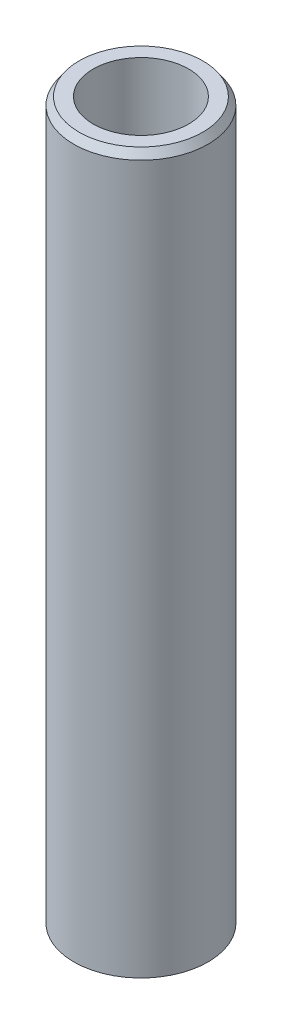
ISO-10303-21;
HEADER;
FILE_DESCRIPTION(('STEP AP214'),'2;1');
FILE_NAME('part.step','',(''),(''),'','','');
FILE_SCHEMA(('AUTOMOTIVE_DESIGN { 1 0 10303 214 1 1 1 1 }'));
ENDSEC;
DATA;
#1=APPLICATION_CONTEXT('core data for automotive mechanical design processes');
#2=APPLICATION_PROTOCOL_DEFINITION('international standard','automotive_design',2000,#1);
#3=PRODUCT_CONTEXT('',#1,'mechanical');
#4=PRODUCT('Part','Part','',(#3));
#5=PRODUCT_RELATED_PRODUCT_CATEGORY('part','',(#4));
#6=PRODUCT_DEFINITION_FORMATION('','',#4);
#7=PRODUCT_DEFINITION_CONTEXT('part definition',#1,'design');
#8=PRODUCT_DEFINITION('design','',#6,#7);
#9=PRODUCT_DEFINITION_SHAPE('','',#8);
#10=(LENGTH_UNIT() NAMED_UNIT(*) SI_UNIT(.MILLI.,.METRE.));
#11=(NAMED_UNIT(*) PLANE_ANGLE_UNIT() SI_UNIT($,.RADIAN.));
#12=(NAMED_UNIT(*) SI_UNIT($,.STERADIAN.) SOLID_ANGLE_UNIT());
#13=UNCERTAINTY_MEASURE_WITH_UNIT(LENGTH_MEASURE(1.E-05),#10,'distance_accuracy_value','');
#14=(GEOMETRIC_REPRESENTATION_CONTEXT(3) GLOBAL_UNCERTAINTY_ASSIGNED_CONTEXT((#13)) GLOBAL_UNIT_ASSIGNED_CONTEXT((#10,
#11,#12)) REPRESENTATION_CONTEXT('',''));
#15=CARTESIAN_POINT('',(0.,0.,0.));
#16=DIRECTION('',(0.,0.,1.));
#17=DIRECTION('',(1.,0.,0.));
#18=AXIS2_PLACEMENT_3D('',#15,#16,#17);
#19=CARTESIAN_POINT('',(0.,536.812885719028,0.));
#20=DIRECTION('',(0.,-1.,0.));
#21=DIRECTION('',(0.,0.,-1.));
#22=AXIS2_PLACEMENT_3D('',#19,#20,#21);
#23=CYLINDRICAL_SURFACE('',#22,50.);
#24=CARTESIAN_POINT('',(0.,531.041514164661,0.));
#25=DIRECTION('',(0.,1.,0.));
#26=DIRECTION('',(0.,0.,1.));
#27=AXIS2_PLACEMENT_3D('',#24,#25,#26);
#28=CIRCLE('',#27,50.);
#29=CARTESIAN_POINT('',(0.,531.041514164661,50.));
#30=VERTEX_POINT('',#29);
#31=EDGE_CURVE('E50',#30,#30,#28,.F.);
#32=ORIENTED_EDGE('',*,*,#31,.T.);
#33=EDGE_LOOP('',(#32));
#34=FACE_BOUND('',#33,.T.);
#35=CARTESIAN_POINT('',(0.,3.96068678921846,0.));
#36=DIRECTION('',(0.,1.,0.));
#37=DIRECTION('',(0.,0.,1.));
#38=AXIS2_PLACEMENT_3D('',#35,#36,#37);
#39=CIRCLE('',#38,50.);
#40=CARTESIAN_POINT('',(0.,3.96068678921846,50.));
#41=VERTEX_POINT('',#40);
#42=EDGE_CURVE('E51',#41,#41,#39,.T.);
#43=ORIENTED_EDGE('',*,*,#42,.T.);
#44=EDGE_LOOP('',(#43));
#45=FACE_BOUND('',#44,.T.);
#46=ADVANCED_FACE('F39',(#34,#45),#23,.T.);
#47=CARTESIAN_POINT('',(0.,536.812885719028,0.));
#48=DIRECTION('',(0.,1.,0.));
#49=DIRECTION('',(0.,0.,1.));
#50=AXIS2_PLACEMENT_3D('',#47,#48,#49);
#51=PLANE('',#50);
#52=CARTESIAN_POINT('',(0.,536.812885719028,0.));
#53=DIRECTION('',(0.,1.,0.));
#54=DIRECTION('',(0.,0.,1.));
#55=AXIS2_PLACEMENT_3D('',#52,#53,#54);
#56=CIRCLE('',#55,46.0393132107815);
#57=CARTESIAN_POINT('',(0.,536.812885719028,46.0393132107815));
#58=VERTEX_POINT('',#57);
#59=EDGE_CURVE('E54',#58,#58,#56,.T.);
#60=ORIENTED_EDGE('',*,*,#59,.T.);
#61=EDGE_LOOP('',(#60));
#62=FACE_BOUND('',#61,.T.);
#63=CARTESIAN_POINT('',(0.,536.812885719028,0.));
#64=DIRECTION('',(0.,1.,0.));
#65=DIRECTION('',(0.,0.,1.));
#66=AXIS2_PLACEMENT_3D('',#63,#64,#65);
#67=CIRCLE('',#66,35.533858966437);
#68=CARTESIAN_POINT('',(0.,536.812885719028,35.533858966437));
#69=VERTEX_POINT('',#68);
#70=EDGE_CURVE('E58',#69,#69,#67,.T.);
#71=ORIENTED_EDGE('',*,*,#70,.F.);
#72=EDGE_LOOP('',(#71));
#73=FACE_BOUND('',#72,.T.);
#74=ADVANCED_FACE('F69',(#62,#73),#51,.T.);
#75=CARTESIAN_POINT('',(0.,0.,0.));
#76=DIRECTION('',(0.,1.,0.));
#77=DIRECTION('',(0.,0.,1.));
#78=AXIS2_PLACEMENT_3D('',#75,#76,#77);
#79=PLANE('',#78);
#80=CARTESIAN_POINT('',(0.,0.,0.));
#81=DIRECTION('',(0.,1.,0.));
#82=DIRECTION('',(0.,0.,1.));
#83=AXIS2_PLACEMENT_3D('',#80,#81,#82);
#84=CIRCLE('',#83,44.2286284456326);
#85=CARTESIAN_POINT('',(0.,0.,44.2286284456326));
#86=VERTEX_POINT('',#85);
#87=EDGE_CURVE('E10',#86,#86,#84,.F.);
#88=ORIENTED_EDGE('',*,*,#87,.T.);
#89=EDGE_LOOP('',(#88));
#90=FACE_BOUND('',#89,.T.);
#91=CARTESIAN_POINT('',(0.,0.,0.));
#92=DIRECTION('',(0.,1.,0.));
#93=DIRECTION('',(0.,0.,1.));
#94=AXIS2_PLACEMENT_3D('',#91,#92,#93);
#95=CIRCLE('',#94,35.533858966437);
#96=CARTESIAN_POINT('',(0.,0.,35.533858966437));
#97=VERTEX_POINT('',#96);
#98=EDGE_CURVE('E63',#97,#97,#95,.T.);
#99=ORIENTED_EDGE('',*,*,#98,.T.);
#100=EDGE_LOOP('',(#99));
#101=FACE_BOUND('',#100,.T.);
#102=ADVANCED_FACE('F75',(#90,#101),#79,.F.);
#103=CARTESIAN_POINT('',(0.,536.812885719028,0.));
#104=DIRECTION('',(0.,-1.,0.));
#105=DIRECTION('',(0.,0.,-1.));
#106=AXIS2_PLACEMENT_3D('',#103,#104,#105);
#107=CYLINDRICAL_SURFACE('',#106,35.533858966437);
#108=ORIENTED_EDGE('',*,*,#70,.T.);
#109=EDGE_LOOP('',(#108));
#110=FACE_BOUND('',#109,.T.);
#111=ORIENTED_EDGE('',*,*,#98,.F.);
#112=EDGE_LOOP('',(#111));
#113=FACE_BOUND('',#112,.T.);
#114=ADVANCED_FACE('F70',(#110,#113),#107,.F.);
#115=CARTESIAN_POINT('',(0.,536.812885719028,0.));
#116=DIRECTION('',(0.,-1.,0.));
#117=DIRECTION('',(0.,0.,-1.));
#118=AXIS2_PLACEMENT_3D('',#115,#116,#117);
#119=CONICAL_SURFACE('',#118,46.0393132107815,0.601447828337336);
#120=ORIENTED_EDGE('',*,*,#31,.F.);
#121=EDGE_LOOP('',(#120));
#122=FACE_BOUND('',#121,.T.);
#123=ORIENTED_EDGE('',*,*,#59,.F.);
#124=EDGE_LOOP('',(#123));
#125=FACE_BOUND('',#124,.T.);
#126=ADVANCED_FACE('F81',(#122,#125),#119,.T.);
#127=CARTESIAN_POINT('',(0.,3.96068678921846,0.));
#128=DIRECTION('',(0.,1.,0.));
#129=DIRECTION('',(0.,0.,1.));
#130=AXIS2_PLACEMENT_3D('',#127,#128,#129);
#131=CONICAL_SURFACE('',#130,50.,0.969348498457569);
#132=ORIENTED_EDGE('',*,*,#87,.F.);
#133=EDGE_LOOP('',(#132));
#134=FACE_BOUND('',#133,.T.);
#135=ORIENTED_EDGE('',*,*,#42,.F.);
#136=EDGE_LOOP('',(#135));
#137=FACE_BOUND('',#136,.T.);
#138=ADVANCED_FACE('F45',(#134,#137),#131,.T.);
#139=CLOSED_SHELL('',(#46,#74,#102,#114,#126,#138));
#140=MANIFOLD_SOLID_BREP('B2',#139);
#141=ADVANCED_BREP_SHAPE_REPRESENTATION('',(#18,#140),#14);
#142=SHAPE_DEFINITION_REPRESENTATION(#9,#141);
ENDSEC;
END-ISO-10303-21;
